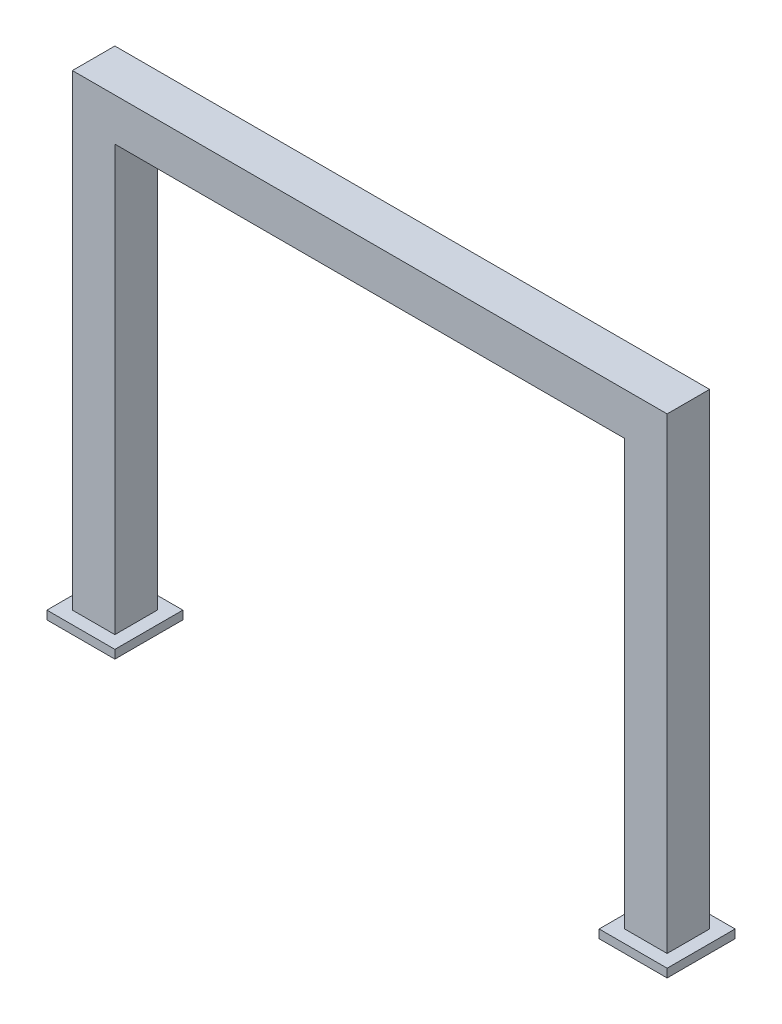
ISO-10303-21;
HEADER;
FILE_DESCRIPTION(('STEP AP214'),'2;1');
FILE_NAME('part.step','',(''),(''),'','','');
FILE_SCHEMA(('AUTOMOTIVE_DESIGN { 1 0 10303 214 1 1 1 1 }'));
ENDSEC;
DATA;
#1=APPLICATION_CONTEXT('core data for automotive mechanical design processes');
#2=APPLICATION_PROTOCOL_DEFINITION('international standard','automotive_design',2000,#1);
#3=PRODUCT_CONTEXT('',#1,'mechanical');
#4=PRODUCT('Part','Part','',(#3));
#5=PRODUCT_RELATED_PRODUCT_CATEGORY('part','',(#4));
#6=PRODUCT_DEFINITION_FORMATION('','',#4);
#7=PRODUCT_DEFINITION_CONTEXT('part definition',#1,'design');
#8=PRODUCT_DEFINITION('design','',#6,#7);
#9=PRODUCT_DEFINITION_SHAPE('','',#8);
#10=(LENGTH_UNIT() NAMED_UNIT(*) SI_UNIT(.MILLI.,.METRE.));
#11=(NAMED_UNIT(*) PLANE_ANGLE_UNIT() SI_UNIT($,.RADIAN.));
#12=(NAMED_UNIT(*) SI_UNIT($,.STERADIAN.) SOLID_ANGLE_UNIT());
#13=UNCERTAINTY_MEASURE_WITH_UNIT(LENGTH_MEASURE(1.E-05),#10,'distance_accuracy_value','');
#14=(GEOMETRIC_REPRESENTATION_CONTEXT(3) GLOBAL_UNCERTAINTY_ASSIGNED_CONTEXT((#13)) GLOBAL_UNIT_ASSIGNED_CONTEXT((#10,
#11,#12)) REPRESENTATION_CONTEXT('',''));
#15=CARTESIAN_POINT('',(0.,0.,0.));
#16=DIRECTION('',(0.,0.,1.));
#17=DIRECTION('',(1.,0.,0.));
#18=AXIS2_PLACEMENT_3D('',#15,#16,#17);
#19=CARTESIAN_POINT('',(-300.,500.,25.));
#20=DIRECTION('',(-1.,0.,0.));
#21=DIRECTION('',(0.,-1.,0.));
#22=AXIS2_PLACEMENT_3D('',#19,#20,#21);
#23=PLANE('',#22);
#24=DIRECTION('',(0.,1.,0.));
#25=VECTOR('',#24,1.);
#26=CARTESIAN_POINT('',(-300.,500.,-25.));
#27=LINE('',#26,#25);
#28=CARTESIAN_POINT('',(-300.,0.,-25.));
#29=VERTEX_POINT('',#28);
#30=CARTESIAN_POINT('',(-300.,500.,-25.));
#31=VERTEX_POINT('',#30);
#32=EDGE_CURVE('E130',#29,#31,#27,.T.);
#33=ORIENTED_EDGE('',*,*,#32,.T.);
#34=DIRECTION('',(0.,0.,-1.));
#35=VECTOR('',#34,1.);
#36=CARTESIAN_POINT('',(-300.,500.,25.));
#37=LINE('',#36,#35);
#38=CARTESIAN_POINT('',(-300.,500.,25.));
#39=VERTEX_POINT('',#38);
#40=EDGE_CURVE('E42',#39,#31,#37,.T.);
#41=ORIENTED_EDGE('',*,*,#40,.F.);
#42=DIRECTION('',(0.,1.,0.));
#43=VECTOR('',#42,1.);
#44=CARTESIAN_POINT('',(-300.,500.,25.));
#45=LINE('',#44,#43);
#46=CARTESIAN_POINT('',(-300.,0.,25.));
#47=VERTEX_POINT('',#46);
#48=EDGE_CURVE('E88',#47,#39,#45,.T.);
#49=ORIENTED_EDGE('',*,*,#48,.F.);
#50=DIRECTION('',(0.,0.,-1.));
#51=VECTOR('',#50,1.);
#52=CARTESIAN_POINT('',(-300.,0.,25.));
#53=LINE('',#52,#51);
#54=EDGE_CURVE('E11',#47,#29,#53,.T.);
#55=ORIENTED_EDGE('',*,*,#54,.T.);
#56=EDGE_LOOP('',(#33,#41,#49,#55));
#57=FACE_BOUND('',#56,.T.);
#58=ADVANCED_FACE('F34',(#57),#23,.F.);
#59=CARTESIAN_POINT('',(300.,500.,25.));
#60=DIRECTION('',(0.,1.,0.));
#61=DIRECTION('',(0.,0.,1.));
#62=AXIS2_PLACEMENT_3D('',#59,#60,#61);
#63=PLANE('',#62);
#64=DIRECTION('',(1.,0.,0.));
#65=VECTOR('',#64,1.);
#66=CARTESIAN_POINT('',(300.,500.,-25.));
#67=LINE('',#66,#65);
#68=CARTESIAN_POINT('',(300.,500.,-25.));
#69=VERTEX_POINT('',#68);
#70=EDGE_CURVE('E133',#31,#69,#67,.T.);
#71=ORIENTED_EDGE('',*,*,#70,.T.);
#72=DIRECTION('',(0.,0.,-1.));
#73=VECTOR('',#72,1.);
#74=CARTESIAN_POINT('',(300.,500.,25.));
#75=LINE('',#74,#73);
#76=CARTESIAN_POINT('',(300.,500.,25.));
#77=VERTEX_POINT('',#76);
#78=EDGE_CURVE('E151',#77,#69,#75,.T.);
#79=ORIENTED_EDGE('',*,*,#78,.F.);
#80=DIRECTION('',(1.,0.,0.));
#81=VECTOR('',#80,1.);
#82=CARTESIAN_POINT('',(300.,500.,25.));
#83=LINE('',#82,#81);
#84=EDGE_CURVE('E159',#39,#77,#83,.T.);
#85=ORIENTED_EDGE('',*,*,#84,.F.);
#86=ORIENTED_EDGE('',*,*,#40,.T.);
#87=EDGE_LOOP('',(#71,#79,#85,#86));
#88=FACE_BOUND('',#87,.T.);
#89=ADVANCED_FACE('F157',(#88),#63,.F.);
#90=CARTESIAN_POINT('',(300.,0.,25.));
#91=DIRECTION('',(1.,0.,0.));
#92=DIRECTION('',(0.,1.,0.));
#93=AXIS2_PLACEMENT_3D('',#90,#91,#92);
#94=PLANE('',#93);
#95=DIRECTION('',(0.,-1.,0.));
#96=VECTOR('',#95,1.);
#97=CARTESIAN_POINT('',(300.,0.,-25.));
#98=LINE('',#97,#96);
#99=CARTESIAN_POINT('',(300.,0.,-25.));
#100=VERTEX_POINT('',#99);
#101=EDGE_CURVE('E135',#69,#100,#98,.T.);
#102=ORIENTED_EDGE('',*,*,#101,.T.);
#103=DIRECTION('',(0.,0.,-1.));
#104=VECTOR('',#103,1.);
#105=CARTESIAN_POINT('',(300.,0.,25.));
#106=LINE('',#105,#104);
#107=CARTESIAN_POINT('',(300.,0.,25.));
#108=VERTEX_POINT('',#107);
#109=EDGE_CURVE('E148',#108,#100,#106,.T.);
#110=ORIENTED_EDGE('',*,*,#109,.F.);
#111=DIRECTION('',(0.,-1.,0.));
#112=VECTOR('',#111,1.);
#113=CARTESIAN_POINT('',(300.,0.,25.));
#114=LINE('',#113,#112);
#115=EDGE_CURVE('E169',#77,#108,#114,.T.);
#116=ORIENTED_EDGE('',*,*,#115,.F.);
#117=ORIENTED_EDGE('',*,*,#78,.T.);
#118=EDGE_LOOP('',(#102,#110,#116,#117));
#119=FACE_BOUND('',#118,.T.);
#120=ADVANCED_FACE('F167',(#119),#94,.F.);
#121=CARTESIAN_POINT('',(350.,550.,25.));
#122=DIRECTION('',(-1.,0.,0.));
#123=DIRECTION('',(0.,-1.,0.));
#124=AXIS2_PLACEMENT_3D('',#121,#122,#123);
#125=PLANE('',#124);
#126=DIRECTION('',(0.,1.,0.));
#127=VECTOR('',#126,1.);
#128=CARTESIAN_POINT('',(350.,550.,-25.));
#129=LINE('',#128,#127);
#130=CARTESIAN_POINT('',(350.,0.,-25.));
#131=VERTEX_POINT('',#130);
#132=CARTESIAN_POINT('',(350.,550.,-25.));
#133=VERTEX_POINT('',#132);
#134=EDGE_CURVE('E117',#131,#133,#129,.T.);
#135=ORIENTED_EDGE('',*,*,#134,.T.);
#136=DIRECTION('',(0.,0.,-1.));
#137=VECTOR('',#136,1.);
#138=CARTESIAN_POINT('',(350.,550.,25.));
#139=LINE('',#138,#137);
#140=CARTESIAN_POINT('',(350.,550.,25.));
#141=VERTEX_POINT('',#140);
#142=EDGE_CURVE('E114',#141,#133,#139,.T.);
#143=ORIENTED_EDGE('',*,*,#142,.F.);
#144=DIRECTION('',(0.,1.,0.));
#145=VECTOR('',#144,1.);
#146=CARTESIAN_POINT('',(350.,550.,25.));
#147=LINE('',#146,#145);
#148=CARTESIAN_POINT('',(350.,0.,25.));
#149=VERTEX_POINT('',#148);
#150=EDGE_CURVE('E103',#149,#141,#147,.T.);
#151=ORIENTED_EDGE('',*,*,#150,.F.);
#152=DIRECTION('',(0.,0.,-1.));
#153=VECTOR('',#152,1.);
#154=CARTESIAN_POINT('',(350.,0.,25.));
#155=LINE('',#154,#153);
#156=EDGE_CURVE('E118',#149,#131,#155,.T.);
#157=ORIENTED_EDGE('',*,*,#156,.T.);
#158=EDGE_LOOP('',(#135,#143,#151,#157));
#159=FACE_BOUND('',#158,.T.);
#160=ADVANCED_FACE('F115',(#159),#125,.F.);
#161=CARTESIAN_POINT('',(-350.,550.,25.));
#162=DIRECTION('',(0.,-1.,0.));
#163=DIRECTION('',(0.,0.,-1.));
#164=AXIS2_PLACEMENT_3D('',#161,#162,#163);
#165=PLANE('',#164);
#166=DIRECTION('',(-1.,0.,0.));
#167=VECTOR('',#166,1.);
#168=CARTESIAN_POINT('',(-350.,550.,-25.));
#169=LINE('',#168,#167);
#170=CARTESIAN_POINT('',(-350.,550.,-25.));
#171=VERTEX_POINT('',#170);
#172=EDGE_CURVE('E74',#133,#171,#169,.T.);
#173=ORIENTED_EDGE('',*,*,#172,.T.);
#174=DIRECTION('',(0.,0.,-1.));
#175=VECTOR('',#174,1.);
#176=CARTESIAN_POINT('',(-350.,550.,25.));
#177=LINE('',#176,#175);
#178=CARTESIAN_POINT('',(-350.,550.,25.));
#179=VERTEX_POINT('',#178);
#180=EDGE_CURVE('E119',#179,#171,#177,.T.);
#181=ORIENTED_EDGE('',*,*,#180,.F.);
#182=DIRECTION('',(-1.,0.,0.));
#183=VECTOR('',#182,1.);
#184=CARTESIAN_POINT('',(-350.,550.,25.));
#185=LINE('',#184,#183);
#186=EDGE_CURVE('E107',#141,#179,#185,.T.);
#187=ORIENTED_EDGE('',*,*,#186,.F.);
#188=ORIENTED_EDGE('',*,*,#142,.T.);
#189=EDGE_LOOP('',(#173,#181,#187,#188));
#190=FACE_BOUND('',#189,.T.);
#191=ADVANCED_FACE('F121',(#190),#165,.F.);
#192=CARTESIAN_POINT('',(-350.,0.,25.));
#193=DIRECTION('',(1.,0.,0.));
#194=DIRECTION('',(0.,0.,-1.));
#195=AXIS2_PLACEMENT_3D('',#192,#193,#194);
#196=PLANE('',#195);
#197=DIRECTION('',(0.,-1.,0.));
#198=VECTOR('',#197,1.);
#199=CARTESIAN_POINT('',(-350.,0.,-25.));
#200=LINE('',#199,#198);
#201=CARTESIAN_POINT('',(-350.,0.,-25.));
#202=VERTEX_POINT('',#201);
#203=EDGE_CURVE('E80',#171,#202,#200,.T.);
#204=ORIENTED_EDGE('',*,*,#203,.T.);
#205=DIRECTION('',(0.,0.,-1.));
#206=VECTOR('',#205,1.);
#207=CARTESIAN_POINT('',(-350.,0.,25.));
#208=LINE('',#207,#206);
#209=CARTESIAN_POINT('',(-350.,0.,25.));
#210=VERTEX_POINT('',#209);
#211=EDGE_CURVE('E123',#210,#202,#208,.T.);
#212=ORIENTED_EDGE('',*,*,#211,.F.);
#213=DIRECTION('',(0.,-1.,0.));
#214=VECTOR('',#213,1.);
#215=CARTESIAN_POINT('',(-350.,0.,25.));
#216=LINE('',#215,#214);
#217=EDGE_CURVE('E50',#179,#210,#216,.T.);
#218=ORIENTED_EDGE('',*,*,#217,.F.);
#219=ORIENTED_EDGE('',*,*,#180,.T.);
#220=EDGE_LOOP('',(#204,#212,#218,#219));
#221=FACE_BOUND('',#220,.T.);
#222=ADVANCED_FACE('F363',(#221),#196,.F.);
#223=CARTESIAN_POINT('',(0.,0.,25.));
#224=DIRECTION('',(0.,0.,-1.));
#225=DIRECTION('',(-1.,0.,0.));
#226=AXIS2_PLACEMENT_3D('',#223,#224,#225);
#227=PLANE('',#226);
#228=DIRECTION('',(1.,0.,0.));
#229=VECTOR('',#228,1.);
#230=CARTESIAN_POINT('',(-300.,0.,25.));
#231=LINE('',#230,#229);
#232=EDGE_CURVE('E143',#210,#47,#231,.T.);
#233=ORIENTED_EDGE('',*,*,#232,.T.);
#234=ORIENTED_EDGE('',*,*,#48,.T.);
#235=ORIENTED_EDGE('',*,*,#84,.T.);
#236=ORIENTED_EDGE('',*,*,#115,.T.);
#237=DIRECTION('',(1.,0.,0.));
#238=VECTOR('',#237,1.);
#239=CARTESIAN_POINT('',(350.,0.,25.));
#240=LINE('',#239,#238);
#241=EDGE_CURVE('E109',#108,#149,#240,.T.);
#242=ORIENTED_EDGE('',*,*,#241,.T.);
#243=ORIENTED_EDGE('',*,*,#150,.T.);
#244=ORIENTED_EDGE('',*,*,#186,.T.);
#245=ORIENTED_EDGE('',*,*,#217,.T.);
#246=EDGE_LOOP('',(#233,#234,#235,#236,#242,#243,#244,#245));
#247=FACE_BOUND('',#246,.T.);
#248=ADVANCED_FACE('F105',(#247),#227,.F.);
#249=CARTESIAN_POINT('',(0.,0.,-25.));
#250=DIRECTION('',(0.,0.,-1.));
#251=DIRECTION('',(-1.,0.,0.));
#252=AXIS2_PLACEMENT_3D('',#249,#250,#251);
#253=PLANE('',#252);
#254=DIRECTION('',(1.,0.,0.));
#255=VECTOR('',#254,1.);
#256=CARTESIAN_POINT('',(-300.,0.,-25.));
#257=LINE('',#256,#255);
#258=EDGE_CURVE('E127',#202,#29,#257,.T.);
#259=ORIENTED_EDGE('',*,*,#258,.F.);
#260=ORIENTED_EDGE('',*,*,#203,.F.);
#261=ORIENTED_EDGE('',*,*,#172,.F.);
#262=ORIENTED_EDGE('',*,*,#134,.F.);
#263=DIRECTION('',(1.,0.,0.));
#264=VECTOR('',#263,1.);
#265=CARTESIAN_POINT('',(350.,0.,-25.));
#266=LINE('',#265,#264);
#267=EDGE_CURVE('E137',#100,#131,#266,.T.);
#268=ORIENTED_EDGE('',*,*,#267,.F.);
#269=ORIENTED_EDGE('',*,*,#101,.F.);
#270=ORIENTED_EDGE('',*,*,#70,.F.);
#271=ORIENTED_EDGE('',*,*,#32,.F.);
#272=EDGE_LOOP('',(#259,#260,#261,#262,#268,#269,#270,#271));
#273=FACE_BOUND('',#272,.T.);
#274=ADVANCED_FACE('F163',(#273),#253,.T.);
#275=CARTESIAN_POINT('',(0.,0.,0.));
#276=DIRECTION('',(0.,-1.,0.));
#277=DIRECTION('',(1.,0.,0.));
#278=AXIS2_PLACEMENT_3D('',#275,#276,#277);
#279=PLANE('',#278);
#280=DIRECTION('',(0.,0.,-1.));
#281=VECTOR('',#280,1.);
#282=CARTESIAN_POINT('',(-365.,0.,-40.));
#283=LINE('',#282,#281);
#284=CARTESIAN_POINT('',(-365.,0.,40.));
#285=VERTEX_POINT('',#284);
#286=CARTESIAN_POINT('',(-365.,0.,-40.));
#287=VERTEX_POINT('',#286);
#288=EDGE_CURVE('E197',#285,#287,#283,.T.);
#289=ORIENTED_EDGE('',*,*,#288,.F.);
#290=DIRECTION('',(-1.,0.,0.));
#291=VECTOR('',#290,1.);
#292=CARTESIAN_POINT('',(-285.,0.,40.));
#293=LINE('',#292,#291);
#294=CARTESIAN_POINT('',(-285.,0.,40.));
#295=VERTEX_POINT('',#294);
#296=EDGE_CURVE('E187',#295,#285,#293,.T.);
#297=ORIENTED_EDGE('',*,*,#296,.F.);
#298=DIRECTION('',(0.,0.,1.));
#299=VECTOR('',#298,1.);
#300=CARTESIAN_POINT('',(-285.,0.,-40.));
#301=LINE('',#300,#299);
#302=CARTESIAN_POINT('',(-285.,0.,-40.));
#303=VERTEX_POINT('',#302);
#304=EDGE_CURVE('E191',#303,#295,#301,.T.);
#305=ORIENTED_EDGE('',*,*,#304,.F.);
#306=DIRECTION('',(1.,0.,0.));
#307=VECTOR('',#306,1.);
#308=CARTESIAN_POINT('',(-285.,0.,-40.));
#309=LINE('',#308,#307);
#310=EDGE_CURVE('E194',#287,#303,#309,.T.);
#311=ORIENTED_EDGE('',*,*,#310,.F.);
#312=EDGE_LOOP('',(#289,#297,#305,#311));
#313=FACE_BOUND('',#312,.T.);
#314=ORIENTED_EDGE('',*,*,#54,.F.);
#315=ORIENTED_EDGE('',*,*,#232,.F.);
#316=ORIENTED_EDGE('',*,*,#211,.T.);
#317=ORIENTED_EDGE('',*,*,#258,.T.);
#318=EDGE_LOOP('',(#314,#315,#316,#317));
#319=FACE_BOUND('',#318,.T.);
#320=ADVANCED_FACE('F307',(#313,#319),#279,.F.);
#321=CARTESIAN_POINT('',(-365.,-10.,-40.));
#322=DIRECTION('',(1.,0.,0.));
#323=DIRECTION('',(0.,1.,0.));
#324=AXIS2_PLACEMENT_3D('',#321,#322,#323);
#325=PLANE('',#324);
#326=ORIENTED_EDGE('',*,*,#288,.T.);
#327=DIRECTION('',(0.,1.,0.));
#328=VECTOR('',#327,1.);
#329=CARTESIAN_POINT('',(-365.,-10.,-40.));
#330=LINE('',#329,#328);
#331=CARTESIAN_POINT('',(-365.,-10.,-40.));
#332=VERTEX_POINT('',#331);
#333=EDGE_CURVE('E131',#332,#287,#330,.T.);
#334=ORIENTED_EDGE('',*,*,#333,.F.);
#335=DIRECTION('',(0.,0.,-1.));
#336=VECTOR('',#335,1.);
#337=CARTESIAN_POINT('',(-365.,-10.,-40.));
#338=LINE('',#337,#336);
#339=CARTESIAN_POINT('',(-365.,-10.,40.));
#340=VERTEX_POINT('',#339);
#341=EDGE_CURVE('E190',#340,#332,#338,.T.);
#342=ORIENTED_EDGE('',*,*,#341,.F.);
#343=DIRECTION('',(0.,1.,0.));
#344=VECTOR('',#343,1.);
#345=CARTESIAN_POINT('',(-365.,-10.,40.));
#346=LINE('',#345,#344);
#347=EDGE_CURVE('E183',#340,#285,#346,.T.);
#348=ORIENTED_EDGE('',*,*,#347,.T.);
#349=EDGE_LOOP('',(#326,#334,#342,#348));
#350=FACE_BOUND('',#349,.T.);
#351=ADVANCED_FACE('F305',(#350),#325,.F.);
#352=CARTESIAN_POINT('',(-285.,-10.,-40.));
#353=DIRECTION('',(0.,0.,1.));
#354=DIRECTION('',(1.,0.,0.));
#355=AXIS2_PLACEMENT_3D('',#352,#353,#354);
#356=PLANE('',#355);
#357=ORIENTED_EDGE('',*,*,#310,.T.);
#358=DIRECTION('',(0.,1.,0.));
#359=VECTOR('',#358,1.);
#360=CARTESIAN_POINT('',(-285.,-10.,-40.));
#361=LINE('',#360,#359);
#362=CARTESIAN_POINT('',(-285.,-10.,-40.));
#363=VERTEX_POINT('',#362);
#364=EDGE_CURVE('E177',#363,#303,#361,.T.);
#365=ORIENTED_EDGE('',*,*,#364,.F.);
#366=DIRECTION('',(1.,0.,0.));
#367=VECTOR('',#366,1.);
#368=CARTESIAN_POINT('',(-285.,-10.,-40.));
#369=LINE('',#368,#367);
#370=EDGE_CURVE('E206',#332,#363,#369,.T.);
#371=ORIENTED_EDGE('',*,*,#370,.F.);
#372=ORIENTED_EDGE('',*,*,#333,.T.);
#373=EDGE_LOOP('',(#357,#365,#371,#372));
#374=FACE_BOUND('',#373,.T.);
#375=ADVANCED_FACE('F311',(#374),#356,.F.);
#376=CARTESIAN_POINT('',(-285.,-10.,-40.));
#377=DIRECTION('',(-1.,0.,0.));
#378=DIRECTION('',(0.,-1.,0.));
#379=AXIS2_PLACEMENT_3D('',#376,#377,#378);
#380=PLANE('',#379);
#381=ORIENTED_EDGE('',*,*,#304,.T.);
#382=DIRECTION('',(0.,1.,0.));
#383=VECTOR('',#382,1.);
#384=CARTESIAN_POINT('',(-285.,-10.,40.));
#385=LINE('',#384,#383);
#386=CARTESIAN_POINT('',(-285.,-10.,40.));
#387=VERTEX_POINT('',#386);
#388=EDGE_CURVE('E180',#387,#295,#385,.T.);
#389=ORIENTED_EDGE('',*,*,#388,.F.);
#390=DIRECTION('',(0.,0.,1.));
#391=VECTOR('',#390,1.);
#392=CARTESIAN_POINT('',(-285.,-10.,-40.));
#393=LINE('',#392,#391);
#394=EDGE_CURVE('E203',#363,#387,#393,.T.);
#395=ORIENTED_EDGE('',*,*,#394,.F.);
#396=ORIENTED_EDGE('',*,*,#364,.T.);
#397=EDGE_LOOP('',(#381,#389,#395,#396));
#398=FACE_BOUND('',#397,.T.);
#399=ADVANCED_FACE('F316',(#398),#380,.F.);
#400=CARTESIAN_POINT('',(-285.,-10.,40.));
#401=DIRECTION('',(0.,0.,-1.));
#402=DIRECTION('',(-1.,0.,0.));
#403=AXIS2_PLACEMENT_3D('',#400,#401,#402);
#404=PLANE('',#403);
#405=ORIENTED_EDGE('',*,*,#296,.T.);
#406=ORIENTED_EDGE('',*,*,#347,.F.);
#407=DIRECTION('',(-1.,0.,0.));
#408=VECTOR('',#407,1.);
#409=CARTESIAN_POINT('',(-285.,-10.,40.));
#410=LINE('',#409,#408);
#411=EDGE_CURVE('E186',#387,#340,#410,.T.);
#412=ORIENTED_EDGE('',*,*,#411,.F.);
#413=ORIENTED_EDGE('',*,*,#388,.T.);
#414=EDGE_LOOP('',(#405,#406,#412,#413));
#415=FACE_BOUND('',#414,.T.);
#416=ADVANCED_FACE('F297',(#415),#404,.F.);
#417=CARTESIAN_POINT('',(0.,-10.,0.));
#418=DIRECTION('',(0.,-1.,0.));
#419=DIRECTION('',(1.,0.,0.));
#420=AXIS2_PLACEMENT_3D('',#417,#418,#419);
#421=PLANE('',#420);
#422=ORIENTED_EDGE('',*,*,#341,.T.);
#423=ORIENTED_EDGE('',*,*,#370,.T.);
#424=ORIENTED_EDGE('',*,*,#394,.T.);
#425=ORIENTED_EDGE('',*,*,#411,.T.);
#426=EDGE_LOOP('',(#422,#423,#424,#425));
#427=FACE_BOUND('',#426,.T.);
#428=ADVANCED_FACE('F314',(#427),#421,.T.);
#429=CARTESIAN_POINT('',(0.,0.,0.));
#430=DIRECTION('',(0.,-1.,0.));
#431=DIRECTION('',(1.,0.,0.));
#432=AXIS2_PLACEMENT_3D('',#429,#430,#431);
#433=PLANE('',#432);
#434=DIRECTION('',(0.,0.,-1.));
#435=VECTOR('',#434,1.);
#436=CARTESIAN_POINT('',(285.,0.,-40.));
#437=LINE('',#436,#435);
#438=CARTESIAN_POINT('',(285.,0.,40.));
#439=VERTEX_POINT('',#438);
#440=CARTESIAN_POINT('',(285.,0.,-40.));
#441=VERTEX_POINT('',#440);
#442=EDGE_CURVE('E233',#439,#441,#437,.T.);
#443=ORIENTED_EDGE('',*,*,#442,.F.);
#444=DIRECTION('',(-1.,0.,0.));
#445=VECTOR('',#444,1.);
#446=CARTESIAN_POINT('',(365.,0.,40.));
#447=LINE('',#446,#445);
#448=CARTESIAN_POINT('',(365.,0.,40.));
#449=VERTEX_POINT('',#448);
#450=EDGE_CURVE('E223',#449,#439,#447,.T.);
#451=ORIENTED_EDGE('',*,*,#450,.F.);
#452=DIRECTION('',(0.,0.,1.));
#453=VECTOR('',#452,1.);
#454=CARTESIAN_POINT('',(365.,0.,-40.));
#455=LINE('',#454,#453);
#456=CARTESIAN_POINT('',(365.,0.,-40.));
#457=VERTEX_POINT('',#456);
#458=EDGE_CURVE('E227',#457,#449,#455,.T.);
#459=ORIENTED_EDGE('',*,*,#458,.F.);
#460=DIRECTION('',(1.,0.,0.));
#461=VECTOR('',#460,1.);
#462=CARTESIAN_POINT('',(365.,0.,-40.));
#463=LINE('',#462,#461);
#464=EDGE_CURVE('E230',#441,#457,#463,.T.);
#465=ORIENTED_EDGE('',*,*,#464,.F.);
#466=EDGE_LOOP('',(#443,#451,#459,#465));
#467=FACE_BOUND('',#466,.T.);
#468=ORIENTED_EDGE('',*,*,#156,.F.);
#469=ORIENTED_EDGE('',*,*,#241,.F.);
#470=ORIENTED_EDGE('',*,*,#109,.T.);
#471=ORIENTED_EDGE('',*,*,#267,.T.);
#472=EDGE_LOOP('',(#468,#469,#470,#471));
#473=FACE_BOUND('',#472,.T.);
#474=ADVANCED_FACE('F332',(#467,#473),#433,.F.);
#475=CARTESIAN_POINT('',(285.,-9.99999999999997,-40.));
#476=DIRECTION('',(1.,0.,0.));
#477=DIRECTION('',(0.,1.,0.));
#478=AXIS2_PLACEMENT_3D('',#475,#476,#477);
#479=PLANE('',#478);
#480=ORIENTED_EDGE('',*,*,#442,.T.);
#481=DIRECTION('',(0.,1.,0.));
#482=VECTOR('',#481,1.);
#483=CARTESIAN_POINT('',(285.,-9.99999999999997,-40.));
#484=LINE('',#483,#482);
#485=CARTESIAN_POINT('',(285.,-9.99999999999997,-40.));
#486=VERTEX_POINT('',#485);
#487=EDGE_CURVE('E200',#486,#441,#484,.T.);
#488=ORIENTED_EDGE('',*,*,#487,.F.);
#489=DIRECTION('',(0.,0.,-1.));
#490=VECTOR('',#489,1.);
#491=CARTESIAN_POINT('',(285.,-9.99999999999997,-40.));
#492=LINE('',#491,#490);
#493=CARTESIAN_POINT('',(285.,-9.99999999999997,40.));
#494=VERTEX_POINT('',#493);
#495=EDGE_CURVE('E226',#494,#486,#492,.T.);
#496=ORIENTED_EDGE('',*,*,#495,.F.);
#497=DIRECTION('',(0.,1.,0.));
#498=VECTOR('',#497,1.);
#499=CARTESIAN_POINT('',(285.,-9.99999999999997,40.));
#500=LINE('',#499,#498);
#501=EDGE_CURVE('E219',#494,#439,#500,.T.);
#502=ORIENTED_EDGE('',*,*,#501,.T.);
#503=EDGE_LOOP('',(#480,#488,#496,#502));
#504=FACE_BOUND('',#503,.T.);
#505=ADVANCED_FACE('F259',(#504),#479,.F.);
#506=CARTESIAN_POINT('',(365.,-9.99999999999996,-40.));
#507=DIRECTION('',(0.,0.,1.));
#508=DIRECTION('',(1.,0.,0.));
#509=AXIS2_PLACEMENT_3D('',#506,#507,#508);
#510=PLANE('',#509);
#511=ORIENTED_EDGE('',*,*,#464,.T.);
#512=DIRECTION('',(0.,1.,0.));
#513=VECTOR('',#512,1.);
#514=CARTESIAN_POINT('',(365.,-9.99999999999996,-40.));
#515=LINE('',#514,#513);
#516=CARTESIAN_POINT('',(365.,-9.99999999999996,-40.));
#517=VERTEX_POINT('',#516);
#518=EDGE_CURVE('E213',#517,#457,#515,.T.);
#519=ORIENTED_EDGE('',*,*,#518,.F.);
#520=DIRECTION('',(1.,0.,0.));
#521=VECTOR('',#520,1.);
#522=CARTESIAN_POINT('',(365.,-9.99999999999996,-40.));
#523=LINE('',#522,#521);
#524=EDGE_CURVE('E241',#486,#517,#523,.T.);
#525=ORIENTED_EDGE('',*,*,#524,.F.);
#526=ORIENTED_EDGE('',*,*,#487,.T.);
#527=EDGE_LOOP('',(#511,#519,#525,#526));
#528=FACE_BOUND('',#527,.T.);
#529=ADVANCED_FACE('F263',(#528),#510,.F.);
#530=CARTESIAN_POINT('',(365.,-9.99999999999996,-40.));
#531=DIRECTION('',(-1.,0.,0.));
#532=DIRECTION('',(0.,-1.,0.));
#533=AXIS2_PLACEMENT_3D('',#530,#531,#532);
#534=PLANE('',#533);
#535=ORIENTED_EDGE('',*,*,#458,.T.);
#536=DIRECTION('',(0.,1.,0.));
#537=VECTOR('',#536,1.);
#538=CARTESIAN_POINT('',(365.,-9.99999999999996,40.));
#539=LINE('',#538,#537);
#540=CARTESIAN_POINT('',(365.,-9.99999999999996,40.));
#541=VERTEX_POINT('',#540);
#542=EDGE_CURVE('E216',#541,#449,#539,.T.);
#543=ORIENTED_EDGE('',*,*,#542,.F.);
#544=DIRECTION('',(0.,0.,1.));
#545=VECTOR('',#544,1.);
#546=CARTESIAN_POINT('',(365.,-9.99999999999996,-40.));
#547=LINE('',#546,#545);
#548=EDGE_CURVE('E238',#517,#541,#547,.T.);
#549=ORIENTED_EDGE('',*,*,#548,.F.);
#550=ORIENTED_EDGE('',*,*,#518,.T.);
#551=EDGE_LOOP('',(#535,#543,#549,#550));
#552=FACE_BOUND('',#551,.T.);
#553=ADVANCED_FACE('F346',(#552),#534,.F.);
#554=CARTESIAN_POINT('',(365.,-9.99999999999996,40.));
#555=DIRECTION('',(0.,0.,-1.));
#556=DIRECTION('',(-1.,0.,0.));
#557=AXIS2_PLACEMENT_3D('',#554,#555,#556);
#558=PLANE('',#557);
#559=ORIENTED_EDGE('',*,*,#450,.T.);
#560=ORIENTED_EDGE('',*,*,#501,.F.);
#561=DIRECTION('',(-1.,0.,0.));
#562=VECTOR('',#561,1.);
#563=CARTESIAN_POINT('',(365.,-9.99999999999996,40.));
#564=LINE('',#563,#562);
#565=EDGE_CURVE('E222',#541,#494,#564,.T.);
#566=ORIENTED_EDGE('',*,*,#565,.F.);
#567=ORIENTED_EDGE('',*,*,#542,.T.);
#568=EDGE_LOOP('',(#559,#560,#566,#567));
#569=FACE_BOUND('',#568,.T.);
#570=ADVANCED_FACE('F343',(#569),#558,.F.);
#571=CARTESIAN_POINT('',(0.,-10.,0.));
#572=DIRECTION('',(0.,-1.,0.));
#573=DIRECTION('',(1.,0.,0.));
#574=AXIS2_PLACEMENT_3D('',#571,#572,#573);
#575=PLANE('',#574);
#576=ORIENTED_EDGE('',*,*,#495,.T.);
#577=ORIENTED_EDGE('',*,*,#524,.T.);
#578=ORIENTED_EDGE('',*,*,#548,.T.);
#579=ORIENTED_EDGE('',*,*,#565,.T.);
#580=EDGE_LOOP('',(#576,#577,#578,#579));
#581=FACE_BOUND('',#580,.T.);
#582=ADVANCED_FACE('F249',(#581),#575,.T.);
#583=CLOSED_SHELL('',(#58,#89,#120,#160,#191,#222,#248,#274,#320,#351,#375,#399,#416,#428,#474,
#505,#529,#553,#570,#582));
#584=MANIFOLD_SOLID_BREP('B2',#583);
#585=ADVANCED_BREP_SHAPE_REPRESENTATION('',(#18,#584),#14);
#586=SHAPE_DEFINITION_REPRESENTATION(#9,#585);
ENDSEC;
END-ISO-10303-21;
